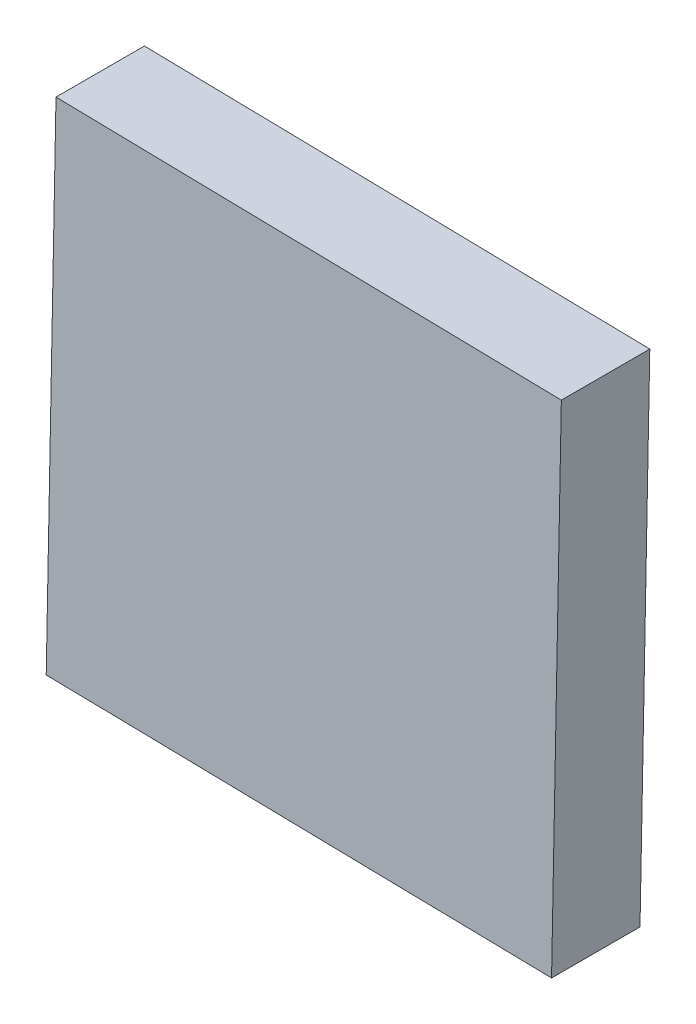
ISO-10303-21;
HEADER;
FILE_DESCRIPTION(('STEP AP214'),'2;1');
FILE_NAME('part.step','',(''),(''),'','','');
FILE_SCHEMA(('AUTOMOTIVE_DESIGN { 1 0 10303 214 1 1 1 1 }'));
ENDSEC;
DATA;
#1=APPLICATION_CONTEXT('core data for automotive mechanical design processes');
#2=APPLICATION_PROTOCOL_DEFINITION('international standard','automotive_design',2000,#1);
#3=PRODUCT_CONTEXT('',#1,'mechanical');
#4=PRODUCT('Part','Part','',(#3));
#5=PRODUCT_RELATED_PRODUCT_CATEGORY('part','',(#4));
#6=PRODUCT_DEFINITION_FORMATION('','',#4);
#7=PRODUCT_DEFINITION_CONTEXT('part definition',#1,'design');
#8=PRODUCT_DEFINITION('design','',#6,#7);
#9=PRODUCT_DEFINITION_SHAPE('','',#8);
#10=(LENGTH_UNIT() NAMED_UNIT(*) SI_UNIT(.MILLI.,.METRE.));
#11=(NAMED_UNIT(*) PLANE_ANGLE_UNIT() SI_UNIT($,.RADIAN.));
#12=(NAMED_UNIT(*) SI_UNIT($,.STERADIAN.) SOLID_ANGLE_UNIT());
#13=UNCERTAINTY_MEASURE_WITH_UNIT(LENGTH_MEASURE(1.E-05),#10,'distance_accuracy_value','');
#14=(GEOMETRIC_REPRESENTATION_CONTEXT(3) GLOBAL_UNCERTAINTY_ASSIGNED_CONTEXT((#13)) GLOBAL_UNIT_ASSIGNED_CONTEXT((#10,
#11,#12)) REPRESENTATION_CONTEXT('',''));
#15=CARTESIAN_POINT('',(0.,0.,0.));
#16=DIRECTION('',(0.,0.,1.));
#17=DIRECTION('',(1.,0.,0.));
#18=AXIS2_PLACEMENT_3D('',#15,#16,#17);
#19=CARTESIAN_POINT('',(-1.67734371468146,2.58988753102079,42.2620965279298));
#20=DIRECTION('',(0.,0.,1.));
#21=DIRECTION('',(0.999812677663925,-0.0193548335692301,0.));
#22=AXIS2_PLACEMENT_3D('',#19,#20,#21);
#23=PLANE('',#22);
#24=DIRECTION('',(0.0193548335692301,0.999812677663925,0.));
#25=VECTOR('',#24,1.);
#26=CARTESIAN_POINT('',(-4.26602919321367,0.0995246070202706,42.2620965279298));
#27=LINE('',#26,#25);
#28=CARTESIAN_POINT('',(-4.26602919321367,0.0995246070202706,42.2620965279298));
#29=VERTEX_POINT('',#28);
#30=CARTESIAN_POINT('',(-4.16770663868199,5.17857300955301,42.2620965279297));
#31=VERTEX_POINT('',#30);
#32=EDGE_CURVE('E72',#29,#31,#27,.T.);
#33=ORIENTED_EDGE('',*,*,#32,.T.);
#34=DIRECTION('',(0.999812677663925,-0.0193548335692299,0.));
#35=VECTOR('',#34,1.);
#36=CARTESIAN_POINT('',(-4.16770663868199,5.17857300955301,42.2620965279297));
#37=LINE('',#36,#35);
#38=CARTESIAN_POINT('',(0.911341763850753,5.08025045502132,42.2620965279299));
#39=VERTEX_POINT('',#38);
#40=EDGE_CURVE('E35',#31,#39,#37,.T.);
#41=ORIENTED_EDGE('',*,*,#40,.T.);
#42=DIRECTION('',(-0.0193548335692301,-0.999812677663925,0.));
#43=VECTOR('',#42,1.);
#44=CARTESIAN_POINT('',(0.813019209319064,0.00120205248858212,42.2620965279299));
#45=LINE('',#44,#43);
#46=CARTESIAN_POINT('',(0.813019209319064,0.00120205248858168,42.2620965279299));
#47=VERTEX_POINT('',#46);
#48=EDGE_CURVE('E95',#39,#47,#45,.T.);
#49=ORIENTED_EDGE('',*,*,#48,.T.);
#50=DIRECTION('',(-0.999812677663925,0.0193548335692299,0.));
#51=VECTOR('',#50,1.);
#52=CARTESIAN_POINT('',(-4.26602919321367,0.0995246070202706,42.2620965279298));
#53=LINE('',#52,#51);
#54=EDGE_CURVE('E70',#47,#29,#53,.T.);
#55=ORIENTED_EDGE('',*,*,#54,.T.);
#56=EDGE_LOOP('',(#33,#41,#49,#55));
#57=FACE_BOUND('',#56,.T.);
#58=ADVANCED_FACE('F32',(#57),#23,.F.);
#59=CARTESIAN_POINT('',(-4.16770663868202,5.17857300955302,43.1510965279297));
#60=DIRECTION('',(-0.0193548335692299,-0.999812677663925,0.));
#61=DIRECTION('',(0.999812677663925,-0.0193548335692299,0.));
#62=AXIS2_PLACEMENT_3D('',#59,#60,#61);
#63=PLANE('',#62);
#64=DIRECTION('',(0.,0.,1.));
#65=VECTOR('',#64,1.);
#66=CARTESIAN_POINT('',(0.911341763850724,5.08025045502133,43.1510965279299));
#67=LINE('',#66,#65);
#68=CARTESIAN_POINT('',(0.911341763850724,5.08025045502133,43.1510965279299));
#69=VERTEX_POINT('',#68);
#70=EDGE_CURVE('E83',#69,#39,#67,.F.);
#71=ORIENTED_EDGE('',*,*,#70,.T.);
#72=ORIENTED_EDGE('',*,*,#40,.F.);
#73=DIRECTION('',(0.,0.,1.));
#74=VECTOR('',#73,1.);
#75=CARTESIAN_POINT('',(-4.16770663868202,5.17857300955302,43.1510965279297));
#76=LINE('',#75,#74);
#77=CARTESIAN_POINT('',(-4.16770663868202,5.17857300955302,43.1510965279297));
#78=VERTEX_POINT('',#77);
#79=EDGE_CURVE('E78',#31,#78,#76,.T.);
#80=ORIENTED_EDGE('',*,*,#79,.T.);
#81=DIRECTION('',(0.999812677663925,-0.0193548335692301,0.));
#82=VECTOR('',#81,1.);
#83=CARTESIAN_POINT('',(-1.62818243741564,5.12941173228718,43.1510965279298));
#84=LINE('',#83,#82);
#85=EDGE_CURVE('E98',#69,#78,#84,.F.);
#86=ORIENTED_EDGE('',*,*,#85,.F.);
#87=EDGE_LOOP('',(#71,#72,#80,#86));
#88=FACE_BOUND('',#87,.T.);
#89=ADVANCED_FACE('F80',(#88),#63,.F.);
#90=CARTESIAN_POINT('',(-4.26602919321371,0.0995246070202831,43.1510965279298));
#91=DIRECTION('',(0.999812677663925,-0.0193548335692301,0.));
#92=DIRECTION('',(0.0193548335692301,0.999812677663925,0.));
#93=AXIS2_PLACEMENT_3D('',#90,#91,#92);
#94=PLANE('',#93);
#95=ORIENTED_EDGE('',*,*,#79,.F.);
#96=ORIENTED_EDGE('',*,*,#32,.F.);
#97=DIRECTION('',(0.,0.,1.));
#98=VECTOR('',#97,1.);
#99=CARTESIAN_POINT('',(-4.26602919321371,0.0995246070202831,43.1510965279298));
#100=LINE('',#99,#98);
#101=CARTESIAN_POINT('',(-4.26602919321371,0.0995246070202831,43.1510965279298));
#102=VERTEX_POINT('',#101);
#103=EDGE_CURVE('E90',#29,#102,#100,.T.);
#104=ORIENTED_EDGE('',*,*,#103,.T.);
#105=DIRECTION('',(0.0193548335692301,0.999812677663925,0.));
#106=VECTOR('',#105,1.);
#107=CARTESIAN_POINT('',(-4.21686791594786,2.63904880828665,43.1510965279297));
#108=LINE('',#107,#106);
#109=EDGE_CURVE('E87',#78,#102,#108,.F.);
#110=ORIENTED_EDGE('',*,*,#109,.F.);
#111=EDGE_LOOP('',(#95,#96,#104,#110));
#112=FACE_BOUND('',#111,.T.);
#113=ADVANCED_FACE('F85',(#112),#94,.F.);
#114=CARTESIAN_POINT('',(-4.26602919321371,0.0995246070202831,43.1510965279298));
#115=DIRECTION('',(0.0193548335692299,0.999812677663925,0.));
#116=DIRECTION('',(-0.999812677663925,0.0193548335692299,0.));
#117=AXIS2_PLACEMENT_3D('',#114,#115,#116);
#118=PLANE('',#117);
#119=ORIENTED_EDGE('',*,*,#103,.F.);
#120=ORIENTED_EDGE('',*,*,#54,.F.);
#121=DIRECTION('',(0.,0.,1.));
#122=VECTOR('',#121,1.);
#123=CARTESIAN_POINT('',(0.813019209319036,0.00120205248859426,43.15109652793));
#124=LINE('',#123,#122);
#125=CARTESIAN_POINT('',(0.813019209319036,0.00120205248859426,43.15109652793));
#126=VERTEX_POINT('',#125);
#127=EDGE_CURVE('E50',#47,#126,#124,.T.);
#128=ORIENTED_EDGE('',*,*,#127,.T.);
#129=DIRECTION('',(0.999812677663925,-0.0193548335692301,0.));
#130=VECTOR('',#129,1.);
#131=CARTESIAN_POINT('',(-1.72650499194733,0.0503633297544385,43.1510965279299));
#132=LINE('',#131,#130);
#133=EDGE_CURVE('E41',#102,#126,#132,.T.);
#134=ORIENTED_EDGE('',*,*,#133,.F.);
#135=EDGE_LOOP('',(#119,#120,#128,#134));
#136=FACE_BOUND('',#135,.T.);
#137=ADVANCED_FACE('F104',(#136),#118,.F.);
#138=CARTESIAN_POINT('',(0.813019209319036,0.00120205248859469,43.15109652793));
#139=DIRECTION('',(-0.999812677663925,0.0193548335692301,0.));
#140=DIRECTION('',(-0.0193548335692301,-0.999812677663925,0.));
#141=AXIS2_PLACEMENT_3D('',#138,#139,#140);
#142=PLANE('',#141);
#143=ORIENTED_EDGE('',*,*,#127,.F.);
#144=ORIENTED_EDGE('',*,*,#48,.F.);
#145=ORIENTED_EDGE('',*,*,#70,.F.);
#146=DIRECTION('',(0.0193548335692301,0.999812677663925,0.));
#147=VECTOR('',#146,1.);
#148=CARTESIAN_POINT('',(0.86218048658488,2.54072625375496,43.15109652793));
#149=LINE('',#148,#147);
#150=EDGE_CURVE('E11',#126,#69,#149,.T.);
#151=ORIENTED_EDGE('',*,*,#150,.F.);
#152=EDGE_LOOP('',(#143,#144,#145,#151));
#153=FACE_BOUND('',#152,.T.);
#154=ADVANCED_FACE('F106',(#153),#142,.F.);
#155=CARTESIAN_POINT('',(-1.67734371468149,2.58988753102081,43.1510965279299));
#156=DIRECTION('',(0.,0.,1.));
#157=DIRECTION('',(0.999812677663925,-0.0193548335692301,0.));
#158=AXIS2_PLACEMENT_3D('',#155,#156,#157);
#159=PLANE('',#158);
#160=ORIENTED_EDGE('',*,*,#133,.T.);
#161=ORIENTED_EDGE('',*,*,#150,.T.);
#162=ORIENTED_EDGE('',*,*,#85,.T.);
#163=ORIENTED_EDGE('',*,*,#109,.T.);
#164=EDGE_LOOP('',(#160,#161,#162,#163));
#165=FACE_BOUND('',#164,.T.);
#166=ADVANCED_FACE('F103',(#165),#159,.T.);
#167=CLOSED_SHELL('',(#58,#89,#113,#137,#154,#166));
#168=MANIFOLD_SOLID_BREP('B2',#167);
#169=ADVANCED_BREP_SHAPE_REPRESENTATION('',(#18,#168),#14);
#170=SHAPE_DEFINITION_REPRESENTATION(#9,#169);
ENDSEC;
END-ISO-10303-21;
